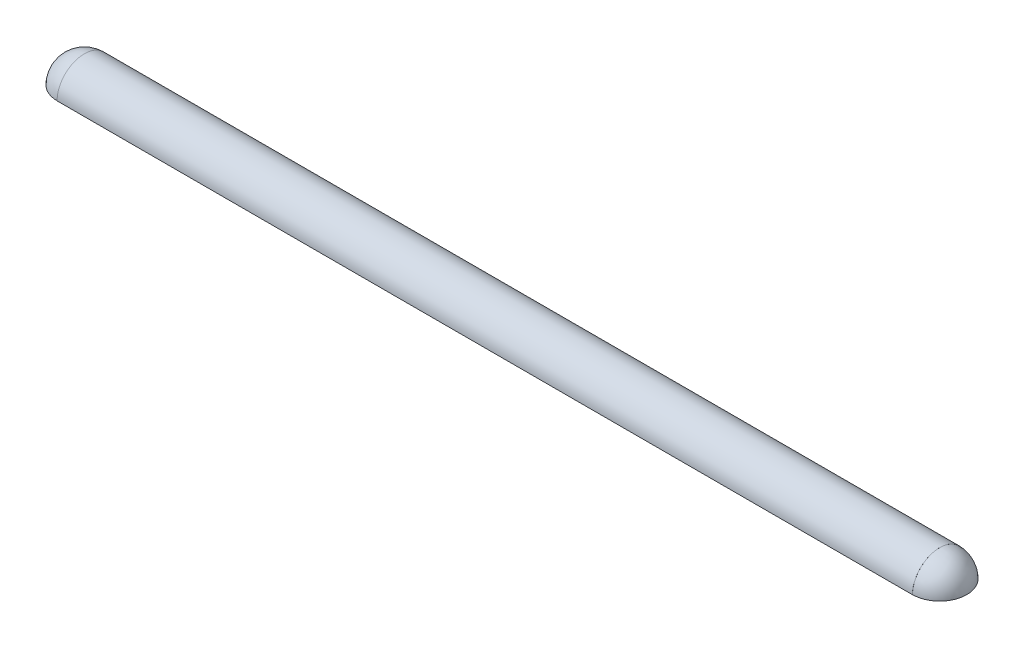
ISO-10303-21;
HEADER;
FILE_DESCRIPTION(('STEP AP214'),'2;1');
FILE_NAME('part.step','',(''),(''),'','','');
FILE_SCHEMA(('AUTOMOTIVE_DESIGN { 1 0 10303 214 1 1 1 1 }'));
ENDSEC;
DATA;
#1=APPLICATION_CONTEXT('core data for automotive mechanical design processes');
#2=APPLICATION_PROTOCOL_DEFINITION('international standard','automotive_design',2000,#1);
#3=PRODUCT_CONTEXT('',#1,'mechanical');
#4=PRODUCT('Part','Part','',(#3));
#5=PRODUCT_RELATED_PRODUCT_CATEGORY('part','',(#4));
#6=PRODUCT_DEFINITION_FORMATION('','',#4);
#7=PRODUCT_DEFINITION_CONTEXT('part definition',#1,'design');
#8=PRODUCT_DEFINITION('design','',#6,#7);
#9=PRODUCT_DEFINITION_SHAPE('','',#8);
#10=(LENGTH_UNIT() NAMED_UNIT(*) SI_UNIT(.MILLI.,.METRE.));
#11=(NAMED_UNIT(*) PLANE_ANGLE_UNIT() SI_UNIT($,.RADIAN.));
#12=(NAMED_UNIT(*) SI_UNIT($,.STERADIAN.) SOLID_ANGLE_UNIT());
#13=UNCERTAINTY_MEASURE_WITH_UNIT(LENGTH_MEASURE(1.E-05),#10,'distance_accuracy_value','');
#14=(GEOMETRIC_REPRESENTATION_CONTEXT(3) GLOBAL_UNCERTAINTY_ASSIGNED_CONTEXT((#13)) GLOBAL_UNIT_ASSIGNED_CONTEXT((#10,
#11,#12)) REPRESENTATION_CONTEXT('',''));
#15=CARTESIAN_POINT('',(0.,0.,0.));
#16=DIRECTION('',(0.,0.,1.));
#17=DIRECTION('',(1.,0.,0.));
#18=AXIS2_PLACEMENT_3D('',#15,#16,#17);
#19=CARTESIAN_POINT('',(-325.12,0.,-20.701));
#20=DIRECTION('',(0.,1.,0.));
#21=DIRECTION('',(0.,0.,1.));
#22=AXIS2_PLACEMENT_3D('',#19,#20,#21);
#23=PLANE('',#22);
#24=DIRECTION('',(0.,0.,1.));
#25=VECTOR('',#24,1.);
#26=CARTESIAN_POINT('',(-325.12,0.,-20.701));
#27=LINE('',#26,#25);
#28=CARTESIAN_POINT('',(-325.12,0.,-20.701));
#29=VERTEX_POINT('',#28);
#30=CARTESIAN_POINT('',(-325.12,0.,-20.6375));
#31=VERTEX_POINT('',#30);
#32=EDGE_CURVE('E162',#29,#31,#27,.T.);
#33=ORIENTED_EDGE('',*,*,#32,.F.);
#34=DIRECTION('',(-1.,0.,0.));
#35=VECTOR('',#34,1.);
#36=CARTESIAN_POINT('',(-325.12,0.,-20.701));
#37=LINE('',#36,#35);
#38=CARTESIAN_POINT('',(325.12,0.,-20.701));
#39=VERTEX_POINT('',#38);
#40=EDGE_CURVE('E158',#39,#29,#37,.T.);
#41=ORIENTED_EDGE('',*,*,#40,.F.);
#42=DIRECTION('',(0.,0.,1.));
#43=VECTOR('',#42,1.);
#44=CARTESIAN_POINT('',(325.12,0.,-20.701));
#45=LINE('',#44,#43);
#46=CARTESIAN_POINT('',(325.12,0.,-20.6375));
#47=VERTEX_POINT('',#46);
#48=EDGE_CURVE('E166',#39,#47,#45,.T.);
#49=ORIENTED_EDGE('',*,*,#48,.T.);
#50=CARTESIAN_POINT('',(325.12,0.,0.));
#51=DIRECTION('',(0.,-1.,0.));
#52=DIRECTION('',(0.,0.,-1.));
#53=AXIS2_PLACEMENT_3D('',#50,#51,#52);
#54=CIRCLE('',#53,20.6375);
#55=CARTESIAN_POINT('',(325.12,0.,20.6375));
#56=VERTEX_POINT('',#55);
#57=EDGE_CURVE('E153',#56,#47,#54,.F.);
#58=ORIENTED_EDGE('',*,*,#57,.F.);
#59=CARTESIAN_POINT('',(325.12,0.,20.701));
#60=VERTEX_POINT('',#59);
#61=EDGE_CURVE('E161',#56,#60,#45,.T.);
#62=ORIENTED_EDGE('',*,*,#61,.T.);
#63=DIRECTION('',(-1.,0.,0.));
#64=VECTOR('',#63,1.);
#65=CARTESIAN_POINT('',(-325.12,0.,20.701));
#66=LINE('',#65,#64);
#67=CARTESIAN_POINT('',(-325.12,0.,20.701));
#68=VERTEX_POINT('',#67);
#69=EDGE_CURVE('E155',#60,#68,#66,.T.);
#70=ORIENTED_EDGE('',*,*,#69,.T.);
#71=CARTESIAN_POINT('',(-325.12,0.,20.6375));
#72=VERTEX_POINT('',#71);
#73=EDGE_CURVE('E165',#72,#68,#27,.T.);
#74=ORIENTED_EDGE('',*,*,#73,.F.);
#75=CARTESIAN_POINT('',(-325.12,0.,0.));
#76=DIRECTION('',(0.,1.,0.));
#77=DIRECTION('',(0.,0.,-1.));
#78=AXIS2_PLACEMENT_3D('',#75,#76,#77);
#79=CIRCLE('',#78,20.6375);
#80=EDGE_CURVE('E147',#72,#31,#79,.F.);
#81=ORIENTED_EDGE('',*,*,#80,.T.);
#82=EDGE_LOOP('',(#33,#41,#49,#58,#62,#70,#74,#81));
#83=FACE_BOUND('',#82,.T.);
#84=DIRECTION('',(-1.,0.,0.));
#85=VECTOR('',#84,1.);
#86=CARTESIAN_POINT('',(321.945,0.,-17.526));
#87=LINE('',#86,#85);
#88=CARTESIAN_POINT('',(321.945,0.,-17.526));
#89=VERTEX_POINT('',#88);
#90=CARTESIAN_POINT('',(-321.945,0.,-17.526));
#91=VERTEX_POINT('',#90);
#92=EDGE_CURVE('E128',#89,#91,#87,.T.);
#93=ORIENTED_EDGE('',*,*,#92,.T.);
#94=DIRECTION('',(0.,0.,1.));
#95=VECTOR('',#94,1.);
#96=CARTESIAN_POINT('',(-321.945,0.,0.));
#97=LINE('',#96,#95);
#98=CARTESIAN_POINT('',(-321.945,0.,-17.1714379493972));
#99=VERTEX_POINT('',#98);
#100=EDGE_CURVE('E115',#91,#99,#97,.T.);
#101=ORIENTED_EDGE('',*,*,#100,.T.);
#102=CARTESIAN_POINT('',(-325.12,0.,0.));
#103=DIRECTION('',(0.,1.,0.));
#104=DIRECTION('',(0.,0.,1.));
#105=AXIS2_PLACEMENT_3D('',#102,#103,#104);
#106=CIRCLE('',#105,17.4625);
#107=CARTESIAN_POINT('',(-321.945,0.,17.1714379493972));
#108=VERTEX_POINT('',#107);
#109=EDGE_CURVE('E121',#108,#99,#106,.F.);
#110=ORIENTED_EDGE('',*,*,#109,.F.);
#111=DIRECTION('',(0.,0.,1.));
#112=VECTOR('',#111,1.);
#113=CARTESIAN_POINT('',(-321.945,0.,0.));
#114=LINE('',#113,#112);
#115=CARTESIAN_POINT('',(-321.945,0.,17.526));
#116=VERTEX_POINT('',#115);
#117=EDGE_CURVE('E58',#108,#116,#114,.T.);
#118=ORIENTED_EDGE('',*,*,#117,.T.);
#119=DIRECTION('',(-1.,0.,0.));
#120=VECTOR('',#119,1.);
#121=CARTESIAN_POINT('',(321.945,0.,17.526));
#122=LINE('',#121,#120);
#123=CARTESIAN_POINT('',(321.945,0.,17.526));
#124=VERTEX_POINT('',#123);
#125=EDGE_CURVE('E138',#124,#116,#122,.T.);
#126=ORIENTED_EDGE('',*,*,#125,.F.);
#127=DIRECTION('',(0.,0.,1.));
#128=VECTOR('',#127,1.);
#129=CARTESIAN_POINT('',(321.945,0.,0.));
#130=LINE('',#129,#128);
#131=CARTESIAN_POINT('',(321.945,0.,17.1714379493972));
#132=VERTEX_POINT('',#131);
#133=EDGE_CURVE('E137',#132,#124,#130,.T.);
#134=ORIENTED_EDGE('',*,*,#133,.F.);
#135=CARTESIAN_POINT('',(325.12,0.,0.));
#136=DIRECTION('',(0.,1.,0.));
#137=DIRECTION('',(0.,0.,1.));
#138=AXIS2_PLACEMENT_3D('',#135,#136,#137);
#139=CIRCLE('',#138,17.4625);
#140=CARTESIAN_POINT('',(321.945,0.,-17.1714379493972));
#141=VERTEX_POINT('',#140);
#142=EDGE_CURVE('E124',#132,#141,#139,.T.);
#143=ORIENTED_EDGE('',*,*,#142,.T.);
#144=DIRECTION('',(0.,0.,1.));
#145=VECTOR('',#144,1.);
#146=CARTESIAN_POINT('',(321.945,0.,0.));
#147=LINE('',#146,#145);
#148=EDGE_CURVE('E133',#89,#141,#147,.T.);
#149=ORIENTED_EDGE('',*,*,#148,.F.);
#150=EDGE_LOOP('',(#93,#101,#110,#118,#126,#134,#143,#149));
#151=FACE_BOUND('',#150,.T.);
#152=ADVANCED_FACE('F40',(#83,#151),#23,.F.);
#153=CARTESIAN_POINT('',(-325.12,0.,0.));
#154=DIRECTION('',(1.,0.,0.));
#155=DIRECTION('',(0.,0.,-1.));
#156=AXIS2_PLACEMENT_3D('',#153,#154,#155);
#157=PLANE('',#156);
#158=CARTESIAN_POINT('',(-325.12,0.,0.));
#159=DIRECTION('',(1.,0.,0.));
#160=DIRECTION('',(0.,0.,-1.));
#161=AXIS2_PLACEMENT_3D('',#158,#159,#160);
#162=CIRCLE('',#161,20.6375);
#163=CARTESIAN_POINT('',(-325.12,20.6375,0.));
#164=VERTEX_POINT('',#163);
#165=EDGE_CURVE('E51',#72,#164,#162,.F.);
#166=ORIENTED_EDGE('',*,*,#165,.F.);
#167=ORIENTED_EDGE('',*,*,#73,.T.);
#168=CARTESIAN_POINT('',(-325.12,0.,0.));
#169=DIRECTION('',(1.,0.,0.));
#170=DIRECTION('',(0.,0.,1.));
#171=AXIS2_PLACEMENT_3D('',#168,#169,#170);
#172=ELLIPSE('',#171,20.701,20.6375);
#173=EDGE_CURVE('E164',#164,#68,#172,.T.);
#174=ORIENTED_EDGE('',*,*,#173,.F.);
#175=EDGE_LOOP('',(#166,#167,#174));
#176=FACE_BOUND('',#175,.T.);
#177=ADVANCED_FACE('F208',(#176),#157,.F.);
#178=CARTESIAN_POINT('',(325.12,0.,0.));
#179=DIRECTION('',(1.,0.,0.));
#180=DIRECTION('',(0.,0.,-1.));
#181=AXIS2_PLACEMENT_3D('',#178,#179,#180);
#182=PLANE('',#181);
#183=ORIENTED_EDGE('',*,*,#61,.F.);
#184=CARTESIAN_POINT('',(325.12,0.,0.));
#185=DIRECTION('',(1.,0.,0.));
#186=DIRECTION('',(0.,0.,-1.));
#187=AXIS2_PLACEMENT_3D('',#184,#185,#186);
#188=CIRCLE('',#187,20.6375);
#189=CARTESIAN_POINT('',(325.12,20.6375,0.));
#190=VERTEX_POINT('',#189);
#191=EDGE_CURVE('E150',#56,#190,#188,.F.);
#192=ORIENTED_EDGE('',*,*,#191,.T.);
#193=CARTESIAN_POINT('',(325.12,0.,0.));
#194=DIRECTION('',(1.,0.,0.));
#195=DIRECTION('',(0.,0.,1.));
#196=AXIS2_PLACEMENT_3D('',#193,#194,#195);
#197=ELLIPSE('',#196,20.701,20.6375);
#198=EDGE_CURVE('E171',#190,#60,#197,.T.);
#199=ORIENTED_EDGE('',*,*,#198,.T.);
#200=EDGE_LOOP('',(#183,#192,#199));
#201=FACE_BOUND('',#200,.T.);
#202=ADVANCED_FACE('F188',(#201),#182,.T.);
#203=DIRECTION('',(-1.,0.,0.));
#204=VECTOR('',#203,1.);
#205=SURFACE_OF_LINEAR_EXTRUSION('',#197,#204);
#206=EDGE_CURVE('E168',#39,#190,#197,.T.);
#207=ORIENTED_EDGE('',*,*,#206,.F.);
#208=ORIENTED_EDGE('',*,*,#40,.T.);
#209=EDGE_CURVE('E45',#29,#164,#172,.T.);
#210=ORIENTED_EDGE('',*,*,#209,.T.);
#211=ORIENTED_EDGE('',*,*,#173,.T.);
#212=ORIENTED_EDGE('',*,*,#69,.F.);
#213=ORIENTED_EDGE('',*,*,#198,.F.);
#214=EDGE_LOOP('',(#207,#208,#210,#211,#212,#213));
#215=FACE_BOUND('',#214,.T.);
#216=ADVANCED_FACE('F42',(#215),#205,.F.);
#217=ORIENTED_EDGE('',*,*,#206,.T.);
#218=EDGE_CURVE('E49',#190,#47,#188,.F.);
#219=ORIENTED_EDGE('',*,*,#218,.T.);
#220=ORIENTED_EDGE('',*,*,#48,.F.);
#221=EDGE_LOOP('',(#217,#219,#220));
#222=FACE_BOUND('',#221,.T.);
#223=ADVANCED_FACE('F214',(#222),#182,.T.);
#224=EDGE_CURVE('E11',#164,#31,#162,.F.);
#225=ORIENTED_EDGE('',*,*,#224,.F.);
#226=ORIENTED_EDGE('',*,*,#209,.F.);
#227=ORIENTED_EDGE('',*,*,#32,.T.);
#228=EDGE_LOOP('',(#225,#226,#227));
#229=FACE_BOUND('',#228,.T.);
#230=ADVANCED_FACE('F191',(#229),#157,.F.);
#231=CARTESIAN_POINT('',(325.12,0.,0.));
#232=DIRECTION('',(0.,0.,1.));
#233=DIRECTION('',(1.,0.,0.));
#234=AXIS2_PLACEMENT_3D('',#231,#232,#233);
#235=SPHERICAL_SURFACE('',#234,20.6375);
#236=ORIENTED_EDGE('',*,*,#191,.F.);
#237=ORIENTED_EDGE('',*,*,#57,.T.);
#238=ORIENTED_EDGE('',*,*,#218,.F.);
#239=EDGE_LOOP('',(#236,#237,#238));
#240=FACE_BOUND('',#239,.T.);
#241=ADVANCED_FACE('F196',(#240),#235,.T.);
#242=CARTESIAN_POINT('',(-325.12,0.,0.));
#243=DIRECTION('',(0.,0.,1.));
#244=DIRECTION('',(-1.,0.,0.));
#245=AXIS2_PLACEMENT_3D('',#242,#243,#244);
#246=SPHERICAL_SURFACE('',#245,20.6375);
#247=ORIENTED_EDGE('',*,*,#165,.T.);
#248=ORIENTED_EDGE('',*,*,#224,.T.);
#249=ORIENTED_EDGE('',*,*,#80,.F.);
#250=EDGE_LOOP('',(#247,#248,#249));
#251=FACE_BOUND('',#250,.T.);
#252=ADVANCED_FACE('F193',(#251),#246,.T.);
#253=CARTESIAN_POINT('',(325.12,0.,0.));
#254=DIRECTION('',(1.,0.,0.));
#255=DIRECTION('',(0.,0.,1.));
#256=AXIS2_PLACEMENT_3D('',#253,#254,#255);
#257=ELLIPSE('',#256,20.701,20.6375);
#258=DIRECTION('',(-1.,0.,0.));
#259=VECTOR('',#258,1.);
#260=SURFACE_OF_LINEAR_EXTRUSION('',#257,#259);
#261=OFFSET_SURFACE('',#260,3.175,.F.);
#262=CARTESIAN_POINT('',(321.945,12.344406180195,-12.3962047307898));
#263=CARTESIAN_POINT('',(321.945,12.6876558764808,-12.0519074694052));
#264=CARTESIAN_POINT('',(321.945,13.0164767990843,-11.6933534058546));
#265=CARTESIAN_POINT('',(321.945,13.6430691461343,-10.9502407434783));
#266=CARTESIAN_POINT('',(321.945,13.9408521153188,-10.5656919019259));
#267=CARTESIAN_POINT('',(321.945,14.503463186005,-9.7731420395852));
#268=CARTESIAN_POINT('',(321.945,14.7682871447045,-9.36513807999588));
#269=CARTESIAN_POINT('',(321.945,15.2631701607025,-8.52851115925927));
#270=CARTESIAN_POINT('',(321.945,15.4932260138608,-8.09988630253542));
#271=CARTESIAN_POINT('',(321.945,15.9169692811666,-7.22504861444906));
#272=CARTESIAN_POINT('',(321.945,16.1106584368571,-6.77883662654493));
#273=CARTESIAN_POINT('',(321.945,16.4603689790562,-5.87189996361997));
#274=CARTESIAN_POINT('',(321.945,16.6163911847394,-5.41117560445821));
#275=CARTESIAN_POINT('',(321.945,16.8897202583277,-4.47838336574457));
#276=CARTESIAN_POINT('',(321.945,17.0070271502808,-4.00631549323893));
#277=CARTESIAN_POINT('',(321.945,17.2021363819358,-3.05408332241167));
#278=CARTESIAN_POINT('',(321.945,17.2799385255499,-2.57391898391424));
#279=CARTESIAN_POINT('',(321.945,17.3955138624939,-1.60880008444702));
#280=CARTESIAN_POINT('',(321.945,17.4332873088498,-1.12384555377615));
#281=CARTESIAN_POINT('',(321.945,17.4685523472091,-0.152474655032876));
#282=CARTESIAN_POINT('',(321.945,17.46604398054,0.333941711539228));
#283=CARTESIAN_POINT('',(321.945,17.4207623115637,1.30489732174597));
#284=CARTESIAN_POINT('',(321.945,17.3779889607891,1.78943656312039));
#285=CARTESIAN_POINT('',(321.945,17.2524646195253,2.75330912251631));
#286=CARTESIAN_POINT('',(321.945,17.1697136232339,3.23264243978223));
#287=CARTESIAN_POINT('',(321.945,16.9647898925628,4.18281021601805));
#288=CARTESIAN_POINT('',(321.945,16.842616932732,4.65364462636711));
#289=CARTESIAN_POINT('',(321.945,16.5596722541847,5.58356975888409));
#290=CARTESIAN_POINT('',(321.945,16.398900534851,6.04266048086426));
#291=CARTESIAN_POINT('',(321.945,16.0398415179863,6.94593537921902));
#292=CARTESIAN_POINT('',(321.945,15.8415538276471,7.39011939945674));
#293=CARTESIAN_POINT('',(321.945,15.4088056153947,8.260503356562));
#294=CARTESIAN_POINT('',(321.945,15.1743451114711,8.6867033023733));
#295=CARTESIAN_POINT('',(321.945,14.6710571990595,9.51780794414855));
#296=CARTESIAN_POINT('',(321.945,14.4022592586378,9.92273048450122));
#297=CARTESIAN_POINT('',(321.945,13.8319677070736,10.7088573469461));
#298=CARTESIAN_POINT('',(321.945,13.5304741427241,11.0900617029818));
#299=CARTESIAN_POINT('',(321.945,12.897408955577,11.8254427229013));
#300=CARTESIAN_POINT('',(321.945,12.5658915550993,12.1796660641788));
#301=CARTESIAN_POINT('',(321.945,11.8745888832068,12.8593600782624));
#302=CARTESIAN_POINT('',(321.945,11.5148037152292,13.1848308562705));
#303=CARTESIAN_POINT('',(321.945,10.7700798967406,13.8041992655092));
#304=CARTESIAN_POINT('',(321.945,10.3851866775744,14.0981515111334));
#305=CARTESIAN_POINT('',(321.945,9.59233258754741,14.6530753864235));
#306=CARTESIAN_POINT('',(321.945,9.18437161954274,14.9140468771845));
#307=CARTESIAN_POINT('',(321.945,8.3487611123976,15.4008292193063));
#308=CARTESIAN_POINT('',(321.945,7.92114297479337,15.6266937854729));
#309=CARTESIAN_POINT('',(321.945,7.26690215310807,15.9382153222444));
#310=CARTESIAN_POINT('',(321.945,7.04667916009019,16.03751263889));
#311=CARTESIAN_POINT('',(321.945,6.60224063477983,16.2268957479029));
#312=CARTESIAN_POINT('',(321.945,6.37802411452541,16.3169792226165));
#313=CARTESIAN_POINT('',(321.945,5.70065040293669,16.5728885810831));
#314=CARTESIAN_POINT('',(321.945,5.24211025694177,16.7246869785942));
#315=CARTESIAN_POINT('',(321.945,4.31401009485313,16.9896682192372));
#316=CARTESIAN_POINT('',(321.945,3.84445018654361,17.1028514398957));
#317=CARTESIAN_POINT('',(321.945,3.13446056286136,17.2430523446835));
#318=CARTESIAN_POINT('',(321.945,2.89687251707195,17.2848551049996));
#319=CARTESIAN_POINT('',(321.945,2.42022478696625,17.3585445394573));
#320=CARTESIAN_POINT('',(321.945,2.18116544127788,17.3904334142585));
#321=CARTESIAN_POINT('',(321.945,1.46243963580966,17.4711270748987));
#322=CARTESIAN_POINT('',(321.945,0.980977791183708,17.5050077691785));
#323=CARTESIAN_POINT('',(321.945,0.258889539749367,17.5257354110312));
#324=CARTESIAN_POINT('',(321.945,0.0185773976714529,17.5276489543121));
#325=CARTESIAN_POINT('',(321.945,-0.461920125296428,17.5215267671029));
#326=CARTESIAN_POINT('',(321.945,-0.702105506183946,17.5134910364208));
#327=CARTESIAN_POINT('',(321.945,-1.42343153466619,17.4743726806463));
#328=CARTESIAN_POINT('',(321.945,-1.90387414666543,17.4282366818548));
#329=CARTESIAN_POINT('',(321.945,-2.6203114553321,17.3292600924301));
#330=CARTESIAN_POINT('',(321.945,-2.85848100628458,17.291292011913));
#331=CARTESIAN_POINT('',(321.945,-3.33309727064207,17.2054857363203));
#332=CARTESIAN_POINT('',(321.945,-3.56954359007125,17.1576453532009));
#333=CARTESIAN_POINT('',(321.945,-4.27540979331637,16.9994810231994));
#334=CARTESIAN_POINT('',(321.945,-4.74161849249422,16.8744777206281));
#335=CARTESIAN_POINT('',(321.945,-5.66205708509082,16.5862071429321));
#336=CARTESIAN_POINT('',(321.945,-6.11628686889194,16.4229395177902));
#337=CARTESIAN_POINT('',(321.945,-6.78623452408631,16.1502518410846));
#338=CARTESIAN_POINT('',(321.945,-7.00768458382464,16.0547078246113));
#339=CARTESIAN_POINT('',(321.945,-7.44637557605251,15.8545434319128));
#340=CARTESIAN_POINT('',(321.945,-7.66361754820173,15.749925333462));
#341=CARTESIAN_POINT('',(321.945,-8.30860081013115,15.4226612084828));
#342=CARTESIAN_POINT('',(321.945,-8.72962802297696,15.1865937155785));
#343=CARTESIAN_POINT('',(321.945,-9.55062480178349,14.6804422390147));
#344=CARTESIAN_POINT('',(321.945,-9.95059486539075,14.4103590597649));
#345=CARTESIAN_POINT('',(321.945,-10.7268304826214,13.8380226161819));
#346=CARTESIAN_POINT('',(321.945,-11.1030961812764,13.5357695487057));
#347=CARTESIAN_POINT('',(321.945,-11.8293465884646,12.9012027366093));
#348=CARTESIAN_POINT('',(321.945,-12.1793316368119,12.5688893807971));
#349=CARTESIAN_POINT('',(321.945,-12.8506633200192,11.8764942869195));
#350=CARTESIAN_POINT('',(321.945,-13.1720099116844,11.5164125069732));
#351=CARTESIAN_POINT('',(321.945,-13.7838911447682,10.7709691681925));
#352=CARTESIAN_POINT('',(321.945,-14.0744262756182,10.3856080110715));
#353=CARTESIAN_POINT('',(321.945,-14.6227388148843,9.59224712544106));
#354=CARTESIAN_POINT('',(321.945,-14.8805162300222,9.18424740157719));
#355=CARTESIAN_POINT('',(321.945,-15.3615840787946,8.3484075216867));
#356=CARTESIAN_POINT('',(321.945,-15.584874979986,7.92056763474889));
#357=CARTESIAN_POINT('',(321.945,-15.9954837372473,7.04796134530307));
#358=CARTESIAN_POINT('',(321.945,-16.1828015886101,6.60319494058024));
#359=CARTESIAN_POINT('',(321.945,-16.5202156906868,5.69976669214834));
#360=CARTESIAN_POINT('',(321.945,-16.6703123361916,5.24110499587919));
#361=CARTESIAN_POINT('',(321.945,-16.9322900315978,4.31299499390298));
#362=CARTESIAN_POINT('',(321.945,-17.0441710799251,3.84354668775166));
#363=CARTESIAN_POINT('',(321.945,-17.2289755475703,2.897047096358));
#364=CARTESIAN_POINT('',(321.945,-17.3018992155399,2.41999585966259));
#365=CARTESIAN_POINT('',(321.945,-17.4083074168929,1.46151515452577));
#366=CARTESIAN_POINT('',(321.945,-17.4417919494637,0.980085685994148));
#367=CARTESIAN_POINT('',(321.945,-17.4691004387329,0.0161040068492075));
#368=CARTESIAN_POINT('',(321.945,-17.4629244562703,-0.4664482020407));
#369=CARTESIAN_POINT('',(321.945,-17.4109528890311,-1.42941443861349));
#370=CARTESIAN_POINT('',(321.945,-17.3651573046763,-1.90982846631913));
#371=CARTESIAN_POINT('',(321.945,-17.2342491857431,-2.8652715485884));
#372=CARTESIAN_POINT('',(321.945,-17.1491365144853,-3.34030058442609));
#373=CARTESIAN_POINT('',(321.945,-16.9401576496343,-4.28175678225561));
#374=CARTESIAN_POINT('',(321.945,-16.8162914576423,-4.74818394460281));
#375=CARTESIAN_POINT('',(321.945,-16.5306256796884,-5.66927839901078));
#376=CARTESIAN_POINT('',(321.945,-16.3688257853091,-6.12394559542453));
#377=CARTESIAN_POINT('',(321.945,-16.008368205395,-7.01842776767245));
#378=CARTESIAN_POINT('',(321.945,-15.8097105223657,-7.45824274451618));
#379=CARTESIAN_POINT('',(321.945,-15.3768580434808,-8.32003071812666));
#380=CARTESIAN_POINT('',(321.945,-15.1426628231522,-8.74200350170292));
#381=CARTESIAN_POINT('',(321.945,-14.6403016269655,-9.56521965759312));
#382=CARTESIAN_POINT('',(321.945,-14.3721356540636,-9.96646303171095));
#383=CARTESIAN_POINT('',(321.945,-13.8036261563478,-10.7454770597074));
#384=CARTESIAN_POINT('',(321.945,-13.5032821646085,-11.1232473728498));
#385=CARTESIAN_POINT('',(321.945,-12.8724399255533,-11.8527117678389));
#386=CARTESIAN_POINT('',(321.945,-12.5419416812885,-12.2044058523242));
#387=CARTESIAN_POINT('',(321.945,-11.8530164403303,-12.87929662501));
#388=CARTESIAN_POINT('',(321.945,-11.4945890097733,-13.202492870347));
#389=CARTESIAN_POINT('',(321.945,-10.7522382221316,-13.8181438747217));
#390=CARTESIAN_POINT('',(321.945,-10.3683148676011,-14.1105986368389));
#391=CARTESIAN_POINT('',(321.945,-9.57757663785138,-14.66273862057));
#392=CARTESIAN_POINT('',(321.945,-9.17076142236495,-14.9224233549002));
#393=CARTESIAN_POINT('',(321.945,-8.33702020026642,-15.4072075559678));
#394=CARTESIAN_POINT('',(321.945,-7.91009419501601,-15.6323070250469));
#395=CARTESIAN_POINT('',(321.945,-7.03904774502248,-16.0463489667059));
#396=CARTESIAN_POINT('',(321.945,-6.59492708274633,-16.2352909816708));
#397=CARTESIAN_POINT('',(321.945,-5.6925447268034,-16.5756892431393));
#398=CARTESIAN_POINT('',(321.945,-5.23428303652851,-16.7271454986342));
#399=CARTESIAN_POINT('',(321.945,-4.30676739565816,-16.9915086349164));
#400=CARTESIAN_POINT('',(321.945,-3.83751335179831,-17.104415188503));
#401=CARTESIAN_POINT('',(321.945,-2.89125097967111,-17.2908819445536));
#402=CARTESIAN_POINT('',(321.945,-2.41424264441626,-17.36444211156));
#403=CARTESIAN_POINT('',(321.945,-1.4558228905586,-17.4716905941857));
#404=CARTESIAN_POINT('',(321.945,-0.97441201252157,-17.5053837403556));
#405=CARTESIAN_POINT('',(321.945,-0.010457428249886,-17.5326765236958));
#406=CARTESIAN_POINT('',(321.945,0.4720862723107,-17.5262763612586));
#407=CARTESIAN_POINT('',(321.945,1.43497104699812,-17.4734283651582));
#408=CARTESIAN_POINT('',(321.945,1.91531214180574,-17.426980908286));
#409=CARTESIAN_POINT('',(321.945,2.87048966927687,-17.2943652989903));
#410=CARTESIAN_POINT('',(321.945,3.34532598186026,-17.2081962817545));
#411=CARTESIAN_POINT('',(321.945,4.28622213328163,-16.9967408838507));
#412=CARTESIAN_POINT('',(321.945,4.75228171873591,-16.8714533756639));
#413=CARTESIAN_POINT('',(321.945,5.67235439810844,-16.5826596347537));
#414=CARTESIAN_POINT('',(321.945,6.12636859083162,-16.4191569015407));
#415=CARTESIAN_POINT('',(321.945,7.01922017136435,-16.0550919375901));
#416=CARTESIAN_POINT('',(321.945,7.45805983371851,-15.8545352897843));
#417=CARTESIAN_POINT('',(321.945,8.31773828075829,-15.4177079434307));
#418=CARTESIAN_POINT('',(321.945,8.73857031043662,-15.1814239909833));
#419=CARTESIAN_POINT('',(321.945,9.72836032159933,-14.5703732711179));
#420=CARTESIAN_POINT('',(321.945,10.2869540901563,-14.1786475974986));
#421=CARTESIAN_POINT('',(321.945,11.3546024036614,-13.332672298629));
#422=CARTESIAN_POINT('',(321.945,11.8636562816679,-12.878421831824));
#423=CARTESIAN_POINT('',(321.945,12.344406180195,-12.3962047307898));
#424=B_SPLINE_CURVE_WITH_KNOTS('',3,(#262,#263,#264,#265,#266,#267,#268,#269,#270,#271,#272,
#273,#274,#275,#276,#277,#278,#279,#280,#281,#282,#283,#284,#285,#286,#287,#288,#289,#290,#291,
#292,#293,#294,#295,#296,#297,#298,#299,#300,#301,#302,#303,#304,#305,#306,#307,#308,#309,#310,
#311,#312,#313,#314,#315,#316,#317,#318,#319,#320,#321,#322,#323,#324,#325,#326,#327,#328,#329,
#330,#331,#332,#333,#334,#335,#336,#337,#338,#339,#340,#341,#342,#343,#344,#345,#346,#347,#348,
#349,#350,#351,#352,#353,#354,#355,#356,#357,#358,#359,#360,#361,#362,#363,#364,#365,#366,#367,
#368,#369,#370,#371,#372,#373,#374,#375,#376,#377,#378,#379,#380,#381,#382,#383,#384,#385,#386,
#387,#388,#389,#390,#391,#392,#393,#394,#395,#396,#397,#398,#399,#400,#401,#402,#403,#404,#405,
#406,#407,#408,#409,#410,#411,#412,#413,#414,#415,#416,#417,#418,#419,#420,#421,#422,#423),
.UNSPECIFIED.,.T.,.F.,(4,2,2,2,2,2,2,2,2,2,2,2,2,2,2,2,2,2,2,2,2,2,2,2,2,2,2,2,2,2,2,2,2,2,2,2,
2,2,2,2,2,2,2,2,2,2,2,2,2,2,2,2,2,2,2,2,2,2,2,2,2,2,2,2,2,2,2,2,2,2,2,2,2,2,2,2,2,2,2,2,4),(0.,
1.45793135785729,2.91531848022489,4.3728886051014,5.8305929741284,7.2882275182108,
8.74583035903869,10.203432294471,11.6610414648612,13.1186414214847,14.5762398826723,
16.0338400983883,17.4914405256547,18.9490492889701,20.4066580755896,21.8642821248404,
23.3219054491825,24.7782861544795,26.2346647754704,27.6884637542588,29.1422574135618,
30.5934898238663,32.0447283461184,33.4937240896465,34.2182674665632,34.9429926495253,
36.390261050366,37.8375153013821,38.5610413803049,39.2844067378636,40.7303825192262,
41.4511745696013,42.1719666338967,43.6179432802224,44.341308928038,45.0648350712264,
46.5110976879622,47.9573735346852,48.6807373263652,49.4039200620302,50.8501932530386,
52.2964322487132,53.7426623949313,55.1888738378848,56.635087462089,58.0812781101547,
59.527468461458,60.9736392040576,62.4198101358907,63.8659657280913,65.3121213798534,
66.7582678011843,68.2044142523125,69.6505584850666,71.0967027024281,72.5428519471125,
73.989001132052,75.4351620752222,76.8813229200912,78.3275010397794,79.7736790336194,
81.2198780153562,82.6660768507617,84.1122981565027,85.5585193173691,87.0047619807187,
88.4510045461439,89.8972654142528,91.3435259354598,92.7897987318791,94.2360728316293,
95.6821716733362,97.1282632872235,98.5743412954921,100.02045078906,101.466601967935,
102.912620769216,104.358421875538,105.804760658344,107.846687935606,109.888642698957),.UNSPECIFIED.);
#425=EDGE_CURVE('E131',#89,#124,#424,.T.);
#426=ORIENTED_EDGE('',*,*,#425,.T.);
#427=ORIENTED_EDGE('',*,*,#125,.T.);
#428=CARTESIAN_POINT('',(-321.945,12.344406180195,-12.3962047307898));
#429=CARTESIAN_POINT('',(-321.945,12.6876558764808,-12.0519074694052));
#430=CARTESIAN_POINT('',(-321.945,13.0164767990843,-11.6933534058546));
#431=CARTESIAN_POINT('',(-321.945,13.6430691461343,-10.9502407434783));
#432=CARTESIAN_POINT('',(-321.945,13.9408521153188,-10.5656919019259));
#433=CARTESIAN_POINT('',(-321.945,14.503463186005,-9.7731420395852));
#434=CARTESIAN_POINT('',(-321.945,14.7682871447045,-9.36513807999588));
#435=CARTESIAN_POINT('',(-321.945,15.2631701607025,-8.52851115925927));
#436=CARTESIAN_POINT('',(-321.945,15.4932260138608,-8.09988630253542));
#437=CARTESIAN_POINT('',(-321.945,15.9169692811666,-7.22504861444906));
#438=CARTESIAN_POINT('',(-321.945,16.1106584368571,-6.77883662654493));
#439=CARTESIAN_POINT('',(-321.945,16.4603689790562,-5.87189996361997));
#440=CARTESIAN_POINT('',(-321.945,16.6163911847394,-5.41117560445821));
#441=CARTESIAN_POINT('',(-321.945,16.8897202583277,-4.47838336574457));
#442=CARTESIAN_POINT('',(-321.945,17.0070271502808,-4.00631549323893));
#443=CARTESIAN_POINT('',(-321.945,17.2021363819358,-3.05408332241167));
#444=CARTESIAN_POINT('',(-321.945,17.2799385255499,-2.57391898391424));
#445=CARTESIAN_POINT('',(-321.945,17.3955138624939,-1.60880008444702));
#446=CARTESIAN_POINT('',(-321.945,17.4332873088498,-1.12384555377615));
#447=CARTESIAN_POINT('',(-321.945,17.4685523472091,-0.152474655032876));
#448=CARTESIAN_POINT('',(-321.945,17.46604398054,0.333941711539228));
#449=CARTESIAN_POINT('',(-321.945,17.4207623115637,1.30489732174597));
#450=CARTESIAN_POINT('',(-321.945,17.3779889607891,1.78943656312039));
#451=CARTESIAN_POINT('',(-321.945,17.2524646195253,2.75330912251631));
#452=CARTESIAN_POINT('',(-321.945,17.1697136232339,3.23264243978223));
#453=CARTESIAN_POINT('',(-321.945,16.9647898925628,4.18281021601805));
#454=CARTESIAN_POINT('',(-321.945,16.842616932732,4.65364462636711));
#455=CARTESIAN_POINT('',(-321.945,16.5596722541847,5.58356975888409));
#456=CARTESIAN_POINT('',(-321.945,16.398900534851,6.04266048086426));
#457=CARTESIAN_POINT('',(-321.945,16.0398415179863,6.94593537921902));
#458=CARTESIAN_POINT('',(-321.945,15.8415538276471,7.39011939945674));
#459=CARTESIAN_POINT('',(-321.945,15.4088056153947,8.260503356562));
#460=CARTESIAN_POINT('',(-321.945,15.1743451114711,8.6867033023733));
#461=CARTESIAN_POINT('',(-321.945,14.6710571990595,9.51780794414855));
#462=CARTESIAN_POINT('',(-321.945,14.4022592586378,9.92273048450122));
#463=CARTESIAN_POINT('',(-321.945,13.8319677070736,10.7088573469461));
#464=CARTESIAN_POINT('',(-321.945,13.5304741427241,11.0900617029818));
#465=CARTESIAN_POINT('',(-321.945,12.897408955577,11.8254427229013));
#466=CARTESIAN_POINT('',(-321.945,12.5658915550993,12.1796660641788));
#467=CARTESIAN_POINT('',(-321.945,11.8745888832068,12.8593600782624));
#468=CARTESIAN_POINT('',(-321.945,11.5148037152292,13.1848308562705));
#469=CARTESIAN_POINT('',(-321.945,10.7700798967406,13.8041992655092));
#470=CARTESIAN_POINT('',(-321.945,10.3851866775744,14.0981515111334));
#471=CARTESIAN_POINT('',(-321.945,9.59233258754741,14.6530753864235));
#472=CARTESIAN_POINT('',(-321.945,9.18437161954274,14.9140468771845));
#473=CARTESIAN_POINT('',(-321.945,8.3487611123976,15.4008292193063));
#474=CARTESIAN_POINT('',(-321.945,7.92114297479337,15.6266937854729));
#475=CARTESIAN_POINT('',(-321.945,7.26690215310807,15.9382153222444));
#476=CARTESIAN_POINT('',(-321.945,7.04667916009019,16.03751263889));
#477=CARTESIAN_POINT('',(-321.945,6.60224063477983,16.2268957479029));
#478=CARTESIAN_POINT('',(-321.945,6.37802411452541,16.3169792226165));
#479=CARTESIAN_POINT('',(-321.945,5.70065040293669,16.5728885810831));
#480=CARTESIAN_POINT('',(-321.945,5.24211025694177,16.7246869785942));
#481=CARTESIAN_POINT('',(-321.945,4.31401009485313,16.9896682192372));
#482=CARTESIAN_POINT('',(-321.945,3.84445018654361,17.1028514398957));
#483=CARTESIAN_POINT('',(-321.945,3.13446056286136,17.2430523446835));
#484=CARTESIAN_POINT('',(-321.945,2.89687251707195,17.2848551049996));
#485=CARTESIAN_POINT('',(-321.945,2.42022478696625,17.3585445394573));
#486=CARTESIAN_POINT('',(-321.945,2.18116544127788,17.3904334142585));
#487=CARTESIAN_POINT('',(-321.945,1.46243963580966,17.4711270748987));
#488=CARTESIAN_POINT('',(-321.945,0.980977791183708,17.5050077691785));
#489=CARTESIAN_POINT('',(-321.945,0.258889539749367,17.5257354110312));
#490=CARTESIAN_POINT('',(-321.945,0.0185773976714529,17.5276489543121));
#491=CARTESIAN_POINT('',(-321.945,-0.461920125296428,17.5215267671029));
#492=CARTESIAN_POINT('',(-321.945,-0.702105506183946,17.5134910364208));
#493=CARTESIAN_POINT('',(-321.945,-1.42343153466619,17.4743726806463));
#494=CARTESIAN_POINT('',(-321.945,-1.90387414666543,17.4282366818548));
#495=CARTESIAN_POINT('',(-321.945,-2.6203114553321,17.3292600924301));
#496=CARTESIAN_POINT('',(-321.945,-2.85848100628458,17.291292011913));
#497=CARTESIAN_POINT('',(-321.945,-3.33309727064207,17.2054857363203));
#498=CARTESIAN_POINT('',(-321.945,-3.56954359007125,17.1576453532009));
#499=CARTESIAN_POINT('',(-321.945,-4.27540979331637,16.9994810231994));
#500=CARTESIAN_POINT('',(-321.945,-4.74161849249422,16.8744777206281));
#501=CARTESIAN_POINT('',(-321.945,-5.66205708509082,16.5862071429321));
#502=CARTESIAN_POINT('',(-321.945,-6.11628686889194,16.4229395177902));
#503=CARTESIAN_POINT('',(-321.945,-6.78623452408631,16.1502518410846));
#504=CARTESIAN_POINT('',(-321.945,-7.00768458382464,16.0547078246113));
#505=CARTESIAN_POINT('',(-321.945,-7.44637557605251,15.8545434319128));
#506=CARTESIAN_POINT('',(-321.945,-7.66361754820173,15.749925333462));
#507=CARTESIAN_POINT('',(-321.945,-8.30860081013115,15.4226612084828));
#508=CARTESIAN_POINT('',(-321.945,-8.72962802297696,15.1865937155785));
#509=CARTESIAN_POINT('',(-321.945,-9.55062480178349,14.6804422390147));
#510=CARTESIAN_POINT('',(-321.945,-9.95059486539075,14.4103590597649));
#511=CARTESIAN_POINT('',(-321.945,-10.7268304826214,13.8380226161819));
#512=CARTESIAN_POINT('',(-321.945,-11.1030961812764,13.5357695487057));
#513=CARTESIAN_POINT('',(-321.945,-11.8293465884646,12.9012027366093));
#514=CARTESIAN_POINT('',(-321.945,-12.1793316368119,12.5688893807971));
#515=CARTESIAN_POINT('',(-321.945,-12.8506633200192,11.8764942869195));
#516=CARTESIAN_POINT('',(-321.945,-13.1720099116844,11.5164125069732));
#517=CARTESIAN_POINT('',(-321.945,-13.7838911447682,10.7709691681925));
#518=CARTESIAN_POINT('',(-321.945,-14.0744262756182,10.3856080110715));
#519=CARTESIAN_POINT('',(-321.945,-14.6227388148843,9.59224712544106));
#520=CARTESIAN_POINT('',(-321.945,-14.8805162300222,9.18424740157719));
#521=CARTESIAN_POINT('',(-321.945,-15.3615840787946,8.3484075216867));
#522=CARTESIAN_POINT('',(-321.945,-15.584874979986,7.92056763474889));
#523=CARTESIAN_POINT('',(-321.945,-15.9954837372473,7.04796134530307));
#524=CARTESIAN_POINT('',(-321.945,-16.1828015886101,6.60319494058024));
#525=CARTESIAN_POINT('',(-321.945,-16.5202156906868,5.69976669214834));
#526=CARTESIAN_POINT('',(-321.945,-16.6703123361916,5.24110499587919));
#527=CARTESIAN_POINT('',(-321.945,-16.9322900315978,4.31299499390298));
#528=CARTESIAN_POINT('',(-321.945,-17.0441710799251,3.84354668775166));
#529=CARTESIAN_POINT('',(-321.945,-17.2289755475703,2.897047096358));
#530=CARTESIAN_POINT('',(-321.945,-17.3018992155399,2.41999585966259));
#531=CARTESIAN_POINT('',(-321.945,-17.4083074168929,1.46151515452577));
#532=CARTESIAN_POINT('',(-321.945,-17.4417919494637,0.980085685994148));
#533=CARTESIAN_POINT('',(-321.945,-17.4691004387329,0.0161040068492075));
#534=CARTESIAN_POINT('',(-321.945,-17.4629244562703,-0.4664482020407));
#535=CARTESIAN_POINT('',(-321.945,-17.4109528890311,-1.42941443861349));
#536=CARTESIAN_POINT('',(-321.945,-17.3651573046763,-1.90982846631913));
#537=CARTESIAN_POINT('',(-321.945,-17.2342491857431,-2.8652715485884));
#538=CARTESIAN_POINT('',(-321.945,-17.1491365144853,-3.34030058442609));
#539=CARTESIAN_POINT('',(-321.945,-16.9401576496343,-4.28175678225561));
#540=CARTESIAN_POINT('',(-321.945,-16.8162914576423,-4.74818394460281));
#541=CARTESIAN_POINT('',(-321.945,-16.5306256796884,-5.66927839901078));
#542=CARTESIAN_POINT('',(-321.945,-16.3688257853091,-6.12394559542453));
#543=CARTESIAN_POINT('',(-321.945,-16.008368205395,-7.01842776767245));
#544=CARTESIAN_POINT('',(-321.945,-15.8097105223657,-7.45824274451618));
#545=CARTESIAN_POINT('',(-321.945,-15.3768580434808,-8.32003071812666));
#546=CARTESIAN_POINT('',(-321.945,-15.1426628231522,-8.74200350170292));
#547=CARTESIAN_POINT('',(-321.945,-14.6403016269655,-9.56521965759312));
#548=CARTESIAN_POINT('',(-321.945,-14.3721356540636,-9.96646303171095));
#549=CARTESIAN_POINT('',(-321.945,-13.8036261563478,-10.7454770597074));
#550=CARTESIAN_POINT('',(-321.945,-13.5032821646085,-11.1232473728498));
#551=CARTESIAN_POINT('',(-321.945,-12.8724399255533,-11.8527117678389));
#552=CARTESIAN_POINT('',(-321.945,-12.5419416812885,-12.2044058523242));
#553=CARTESIAN_POINT('',(-321.945,-11.8530164403303,-12.87929662501));
#554=CARTESIAN_POINT('',(-321.945,-11.4945890097733,-13.202492870347));
#555=CARTESIAN_POINT('',(-321.945,-10.7522382221316,-13.8181438747217));
#556=CARTESIAN_POINT('',(-321.945,-10.3683148676011,-14.1105986368389));
#557=CARTESIAN_POINT('',(-321.945,-9.57757663785138,-14.66273862057));
#558=CARTESIAN_POINT('',(-321.945,-9.17076142236495,-14.9224233549002));
#559=CARTESIAN_POINT('',(-321.945,-8.33702020026642,-15.4072075559678));
#560=CARTESIAN_POINT('',(-321.945,-7.91009419501601,-15.6323070250469));
#561=CARTESIAN_POINT('',(-321.945,-7.03904774502248,-16.0463489667059));
#562=CARTESIAN_POINT('',(-321.945,-6.59492708274633,-16.2352909816708));
#563=CARTESIAN_POINT('',(-321.945,-5.6925447268034,-16.5756892431393));
#564=CARTESIAN_POINT('',(-321.945,-5.23428303652851,-16.7271454986342));
#565=CARTESIAN_POINT('',(-321.945,-4.30676739565816,-16.9915086349164));
#566=CARTESIAN_POINT('',(-321.945,-3.83751335179831,-17.104415188503));
#567=CARTESIAN_POINT('',(-321.945,-2.89125097967111,-17.2908819445536));
#568=CARTESIAN_POINT('',(-321.945,-2.41424264441626,-17.36444211156));
#569=CARTESIAN_POINT('',(-321.945,-1.4558228905586,-17.4716905941857));
#570=CARTESIAN_POINT('',(-321.945,-0.97441201252157,-17.5053837403556));
#571=CARTESIAN_POINT('',(-321.945,-0.010457428249886,-17.5326765236958));
#572=CARTESIAN_POINT('',(-321.945,0.4720862723107,-17.5262763612586));
#573=CARTESIAN_POINT('',(-321.945,1.43497104699812,-17.4734283651582));
#574=CARTESIAN_POINT('',(-321.945,1.91531214180574,-17.426980908286));
#575=CARTESIAN_POINT('',(-321.945,2.87048966927687,-17.2943652989903));
#576=CARTESIAN_POINT('',(-321.945,3.34532598186026,-17.2081962817545));
#577=CARTESIAN_POINT('',(-321.945,4.28622213328163,-16.9967408838507));
#578=CARTESIAN_POINT('',(-321.945,4.75228171873591,-16.8714533756639));
#579=CARTESIAN_POINT('',(-321.945,5.67235439810844,-16.5826596347537));
#580=CARTESIAN_POINT('',(-321.945,6.12636859083162,-16.4191569015407));
#581=CARTESIAN_POINT('',(-321.945,7.01922017136435,-16.0550919375901));
#582=CARTESIAN_POINT('',(-321.945,7.45805983371851,-15.8545352897843));
#583=CARTESIAN_POINT('',(-321.945,8.31773828075829,-15.4177079434307));
#584=CARTESIAN_POINT('',(-321.945,8.73857031043662,-15.1814239909833));
#585=CARTESIAN_POINT('',(-321.945,9.72836032159933,-14.5703732711179));
#586=CARTESIAN_POINT('',(-321.945,10.2869540901563,-14.1786475974986));
#587=CARTESIAN_POINT('',(-321.945,11.3546024036614,-13.332672298629));
#588=CARTESIAN_POINT('',(-321.945,11.8636562816679,-12.878421831824));
#589=CARTESIAN_POINT('',(-321.945,12.344406180195,-12.3962047307898));
#590=B_SPLINE_CURVE_WITH_KNOTS('',3,(#428,#429,#430,#431,#432,#433,#434,#435,#436,#437,#438,
#439,#440,#441,#442,#443,#444,#445,#446,#447,#448,#449,#450,#451,#452,#453,#454,#455,#456,#457,
#458,#459,#460,#461,#462,#463,#464,#465,#466,#467,#468,#469,#470,#471,#472,#473,#474,#475,#476,
#477,#478,#479,#480,#481,#482,#483,#484,#485,#486,#487,#488,#489,#490,#491,#492,#493,#494,#495,
#496,#497,#498,#499,#500,#501,#502,#503,#504,#505,#506,#507,#508,#509,#510,#511,#512,#513,#514,
#515,#516,#517,#518,#519,#520,#521,#522,#523,#524,#525,#526,#527,#528,#529,#530,#531,#532,#533,
#534,#535,#536,#537,#538,#539,#540,#541,#542,#543,#544,#545,#546,#547,#548,#549,#550,#551,#552,
#553,#554,#555,#556,#557,#558,#559,#560,#561,#562,#563,#564,#565,#566,#567,#568,#569,#570,#571,
#572,#573,#574,#575,#576,#577,#578,#579,#580,#581,#582,#583,#584,#585,#586,#587,#588,#589),
.UNSPECIFIED.,.T.,.F.,(4,2,2,2,2,2,2,2,2,2,2,2,2,2,2,2,2,2,2,2,2,2,2,2,2,2,2,2,2,2,2,2,2,2,2,2,
2,2,2,2,2,2,2,2,2,2,2,2,2,2,2,2,2,2,2,2,2,2,2,2,2,2,2,2,2,2,2,2,2,2,2,2,2,2,2,2,2,2,2,2,4),(0.,
1.45793135785729,2.91531848022489,4.3728886051014,5.8305929741284,7.2882275182108,
8.74583035903869,10.203432294471,11.6610414648612,13.1186414214847,14.5762398826723,
16.0338400983883,17.4914405256547,18.9490492889701,20.4066580755896,21.8642821248404,
23.3219054491825,24.7782861544795,26.2346647754704,27.6884637542588,29.1422574135618,
30.5934898238663,32.0447283461184,33.4937240896465,34.2182674665632,34.9429926495253,
36.390261050366,37.8375153013821,38.5610413803049,39.2844067378636,40.7303825192262,
41.4511745696013,42.1719666338967,43.6179432802224,44.341308928038,45.0648350712264,
46.5110976879622,47.9573735346852,48.6807373263652,49.4039200620302,50.8501932530386,
52.2964322487132,53.7426623949313,55.1888738378848,56.635087462089,58.0812781101547,
59.527468461458,60.9736392040576,62.4198101358907,63.8659657280913,65.3121213798534,
66.7582678011843,68.2044142523125,69.6505584850666,71.0967027024281,72.5428519471125,
73.989001132052,75.4351620752222,76.8813229200912,78.3275010397794,79.7736790336194,
81.2198780153562,82.6660768507617,84.1122981565027,85.5585193173691,87.0047619807187,
88.4510045461439,89.8972654142528,91.3435259354598,92.7897987318791,94.2360728316293,
95.6821716733362,97.1282632872235,98.5743412954921,100.02045078906,101.466601967935,
102.912620769216,104.358421875538,105.804760658344,107.846687935606,109.888642698957),.UNSPECIFIED.);
#591=EDGE_CURVE('E129',#91,#116,#590,.T.);
#592=ORIENTED_EDGE('',*,*,#591,.F.);
#593=ORIENTED_EDGE('',*,*,#92,.F.);
#594=EDGE_LOOP('',(#426,#427,#592,#593));
#595=FACE_BOUND('',#594,.T.);
#596=ADVANCED_FACE('F195',(#595),#261,.T.);
#597=CARTESIAN_POINT('',(321.945,0.,0.));
#598=DIRECTION('',(1.,0.,0.));
#599=DIRECTION('',(0.,0.,-1.));
#600=AXIS2_PLACEMENT_3D('',#597,#598,#599);
#601=PLANE('',#600);
#602=ORIENTED_EDGE('',*,*,#425,.F.);
#603=ORIENTED_EDGE('',*,*,#148,.T.);
#604=CARTESIAN_POINT('',(321.945,0.,0.));
#605=DIRECTION('',(1.,0.,0.));
#606=DIRECTION('',(0.,0.,-1.));
#607=AXIS2_PLACEMENT_3D('',#604,#605,#606);
#608=CIRCLE('',#607,17.1714379493972);
#609=EDGE_CURVE('E119',#132,#141,#608,.F.);
#610=ORIENTED_EDGE('',*,*,#609,.F.);
#611=ORIENTED_EDGE('',*,*,#133,.T.);
#612=EDGE_LOOP('',(#602,#603,#610,#611));
#613=FACE_BOUND('',#612,.T.);
#614=ADVANCED_FACE('F202',(#613),#601,.F.);
#615=CARTESIAN_POINT('',(-321.945,0.,0.));
#616=DIRECTION('',(1.,0.,0.));
#617=DIRECTION('',(0.,0.,-1.));
#618=AXIS2_PLACEMENT_3D('',#615,#616,#617);
#619=PLANE('',#618);
#620=CARTESIAN_POINT('',(-321.945,0.,0.));
#621=DIRECTION('',(1.,0.,0.));
#622=DIRECTION('',(0.,0.,-1.));
#623=AXIS2_PLACEMENT_3D('',#620,#621,#622);
#624=CIRCLE('',#623,17.1714379493972);
#625=EDGE_CURVE('E111',#108,#99,#624,.F.);
#626=ORIENTED_EDGE('',*,*,#625,.T.);
#627=ORIENTED_EDGE('',*,*,#100,.F.);
#628=ORIENTED_EDGE('',*,*,#591,.T.);
#629=ORIENTED_EDGE('',*,*,#117,.F.);
#630=EDGE_LOOP('',(#626,#627,#628,#629));
#631=FACE_BOUND('',#630,.T.);
#632=ADVANCED_FACE('F113',(#631),#619,.T.);
#633=CARTESIAN_POINT('',(325.12,0.,0.));
#634=DIRECTION('',(0.,0.,1.));
#635=DIRECTION('',(1.,0.,0.));
#636=AXIS2_PLACEMENT_3D('',#633,#634,#635);
#637=SPHERICAL_SURFACE('',#636,17.4625);
#638=ORIENTED_EDGE('',*,*,#609,.T.);
#639=ORIENTED_EDGE('',*,*,#142,.F.);
#640=EDGE_LOOP('',(#638,#639));
#641=FACE_BOUND('',#640,.T.);
#642=ADVANCED_FACE('F294',(#641),#637,.F.);
#643=CARTESIAN_POINT('',(-325.12,0.,0.));
#644=DIRECTION('',(0.,0.,1.));
#645=DIRECTION('',(-1.,0.,0.));
#646=AXIS2_PLACEMENT_3D('',#643,#644,#645);
#647=SPHERICAL_SURFACE('',#646,17.4625);
#648=ORIENTED_EDGE('',*,*,#109,.T.);
#649=ORIENTED_EDGE('',*,*,#625,.F.);
#650=EDGE_LOOP('',(#648,#649));
#651=FACE_BOUND('',#650,.T.);
#652=ADVANCED_FACE('F122',(#651),#647,.F.);
#653=CLOSED_SHELL('',(#152,#177,#202,#216,#223,#230,#241,#252,#596,#614,#632,#642,#652));
#654=MANIFOLD_SOLID_BREP('B2',#653);
#655=ADVANCED_BREP_SHAPE_REPRESENTATION('',(#18,#654),#14);
#656=SHAPE_DEFINITION_REPRESENTATION(#9,#655);
ENDSEC;
END-ISO-10303-21;
